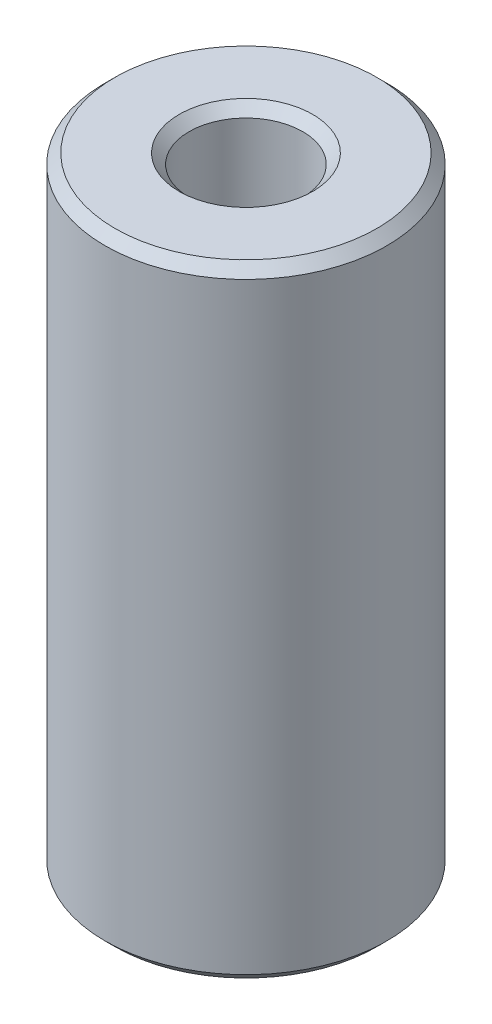
ISO-10303-21;
HEADER;
FILE_DESCRIPTION(('STEP AP214'),'2;1');
FILE_NAME('part.step','',(''),(''),'','','');
FILE_SCHEMA(('AUTOMOTIVE_DESIGN { 1 0 10303 214 1 1 1 1 }'));
ENDSEC;
DATA;
#1=APPLICATION_CONTEXT('core data for automotive mechanical design processes');
#2=APPLICATION_PROTOCOL_DEFINITION('international standard','automotive_design',2000,#1);
#3=PRODUCT_CONTEXT('',#1,'mechanical');
#4=PRODUCT('Part','Part','',(#3));
#5=PRODUCT_RELATED_PRODUCT_CATEGORY('part','',(#4));
#6=PRODUCT_DEFINITION_FORMATION('','',#4);
#7=PRODUCT_DEFINITION_CONTEXT('part definition',#1,'design');
#8=PRODUCT_DEFINITION('design','',#6,#7);
#9=PRODUCT_DEFINITION_SHAPE('','',#8);
#10=(LENGTH_UNIT() NAMED_UNIT(*) SI_UNIT(.MILLI.,.METRE.));
#11=(NAMED_UNIT(*) PLANE_ANGLE_UNIT() SI_UNIT($,.RADIAN.));
#12=(NAMED_UNIT(*) SI_UNIT($,.STERADIAN.) SOLID_ANGLE_UNIT());
#13=UNCERTAINTY_MEASURE_WITH_UNIT(LENGTH_MEASURE(1.E-05),#10,'distance_accuracy_value','');
#14=(GEOMETRIC_REPRESENTATION_CONTEXT(3) GLOBAL_UNCERTAINTY_ASSIGNED_CONTEXT((#13)) GLOBAL_UNIT_ASSIGNED_CONTEXT((#10,
#11,#12)) REPRESENTATION_CONTEXT('',''));
#15=CARTESIAN_POINT('',(0.,0.,0.));
#16=DIRECTION('',(0.,0.,1.));
#17=DIRECTION('',(1.,0.,0.));
#18=AXIS2_PLACEMENT_3D('',#15,#16,#17);
#19=CARTESIAN_POINT('',(0.,99.3283086038093,0.));
#20=DIRECTION('',(0.,-1.,0.));
#21=DIRECTION('',(0.,0.,-1.));
#22=AXIS2_PLACEMENT_3D('',#19,#20,#21);
#23=CYLINDRICAL_SURFACE('',#22,22.5);
#24=CARTESIAN_POINT('',(0.,1.59020851272115,0.));
#25=DIRECTION('',(0.,1.,0.));
#26=DIRECTION('',(0.,0.,1.));
#27=AXIS2_PLACEMENT_3D('',#24,#25,#26);
#28=CIRCLE('',#27,22.5);
#29=CARTESIAN_POINT('',(0.,1.59020851272115,22.5));
#30=VERTEX_POINT('',#29);
#31=EDGE_CURVE('E10',#30,#30,#28,.T.);
#32=ORIENTED_EDGE('',*,*,#31,.T.);
#33=EDGE_LOOP('',(#32));
#34=FACE_BOUND('',#33,.T.);
#35=CARTESIAN_POINT('',(0.,97.7381000910882,0.));
#36=DIRECTION('',(0.,1.,0.));
#37=DIRECTION('',(0.,0.,1.));
#38=AXIS2_PLACEMENT_3D('',#35,#36,#37);
#39=CIRCLE('',#38,22.5);
#40=CARTESIAN_POINT('',(0.,97.7381000910882,22.5));
#41=VERTEX_POINT('',#40);
#42=EDGE_CURVE('E50',#41,#41,#39,.F.);
#43=ORIENTED_EDGE('',*,*,#42,.T.);
#44=EDGE_LOOP('',(#43));
#45=FACE_BOUND('',#44,.T.);
#46=ADVANCED_FACE('F39',(#34,#45),#23,.T.);
#47=CARTESIAN_POINT('',(0.,99.3283086038093,0.));
#48=DIRECTION('',(0.,1.,0.));
#49=DIRECTION('',(0.,0.,1.));
#50=AXIS2_PLACEMENT_3D('',#47,#48,#49);
#51=PLANE('',#50);
#52=CARTESIAN_POINT('',(0.,99.3283086038093,0.));
#53=DIRECTION('',(0.,1.,0.));
#54=DIRECTION('',(0.,0.,1.));
#55=AXIS2_PLACEMENT_3D('',#52,#53,#54);
#56=CIRCLE('',#55,10.6645658844029);
#57=CARTESIAN_POINT('',(0.,99.3283086038093,10.6645658844029));
#58=VERTEX_POINT('',#57);
#59=EDGE_CURVE('E58',#58,#58,#56,.F.);
#60=ORIENTED_EDGE('',*,*,#59,.T.);
#61=EDGE_LOOP('',(#60));
#62=FACE_BOUND('',#61,.T.);
#63=CARTESIAN_POINT('',(0.,99.3283086038093,0.));
#64=DIRECTION('',(0.,1.,0.));
#65=DIRECTION('',(0.,0.,1.));
#66=AXIS2_PLACEMENT_3D('',#63,#64,#65);
#67=CIRCLE('',#66,20.9097914872789);
#68=CARTESIAN_POINT('',(0.,99.3283086038093,20.9097914872789));
#69=VERTEX_POINT('',#68);
#70=EDGE_CURVE('E61',#69,#69,#67,.T.);
#71=ORIENTED_EDGE('',*,*,#70,.T.);
#72=EDGE_LOOP('',(#71));
#73=FACE_BOUND('',#72,.T.);
#74=ADVANCED_FACE('F88',(#62,#73),#51,.T.);
#75=CARTESIAN_POINT('',(0.,0.,0.));
#76=DIRECTION('',(0.,1.,0.));
#77=DIRECTION('',(0.,0.,1.));
#78=AXIS2_PLACEMENT_3D('',#75,#76,#77);
#79=PLANE('',#78);
#80=CARTESIAN_POINT('',(0.,0.,0.));
#81=DIRECTION('',(0.,1.,0.));
#82=DIRECTION('',(0.,0.,1.));
#83=AXIS2_PLACEMENT_3D('',#80,#81,#82);
#84=CIRCLE('',#83,10.6645658844029);
#85=CARTESIAN_POINT('',(0.,0.,-10.6645658844029));
#86=VERTEX_POINT('',#85);
#87=EDGE_CURVE('E51',#86,#86,#84,.T.);
#88=ORIENTED_EDGE('',*,*,#87,.T.);
#89=EDGE_LOOP('',(#88));
#90=FACE_BOUND('',#89,.T.);
#91=CARTESIAN_POINT('',(0.,0.,0.));
#92=DIRECTION('',(0.,1.,0.));
#93=DIRECTION('',(0.,0.,1.));
#94=AXIS2_PLACEMENT_3D('',#91,#92,#93);
#95=CIRCLE('',#94,20.9097914872788);
#96=CARTESIAN_POINT('',(0.,0.,20.9097914872788));
#97=VERTEX_POINT('',#96);
#98=EDGE_CURVE('E54',#97,#97,#95,.F.);
#99=ORIENTED_EDGE('',*,*,#98,.T.);
#100=EDGE_LOOP('',(#99));
#101=FACE_BOUND('',#100,.T.);
#102=ADVANCED_FACE('F83',(#90,#101),#79,.F.);
#103=CARTESIAN_POINT('',(0.,99.3283086038093,0.));
#104=DIRECTION('',(0.,-1.,0.));
#105=DIRECTION('',(0.,0.,-1.));
#106=AXIS2_PLACEMENT_3D('',#103,#104,#105);
#107=CYLINDRICAL_SURFACE('',#106,9.07435737168178);
#108=CARTESIAN_POINT('',(0.,97.7381000910882,0.));
#109=DIRECTION('',(0.,1.,0.));
#110=DIRECTION('',(0.,0.,1.));
#111=AXIS2_PLACEMENT_3D('',#108,#109,#110);
#112=CIRCLE('',#111,9.07435737168178);
#113=CARTESIAN_POINT('',(0.,97.7381000910882,9.07435737168178));
#114=VERTEX_POINT('',#113);
#115=EDGE_CURVE('E67',#114,#114,#112,.T.);
#116=ORIENTED_EDGE('',*,*,#115,.T.);
#117=EDGE_LOOP('',(#116));
#118=FACE_BOUND('',#117,.T.);
#119=CARTESIAN_POINT('',(0.,1.59020851272115,0.));
#120=DIRECTION('',(0.,1.,0.));
#121=DIRECTION('',(0.,0.,1.));
#122=AXIS2_PLACEMENT_3D('',#119,#120,#121);
#123=CIRCLE('',#122,9.07435737168178);
#124=CARTESIAN_POINT('',(0.,1.59020851272115,-9.07435737168178));
#125=VERTEX_POINT('',#124);
#126=EDGE_CURVE('E69',#125,#125,#123,.F.);
#127=ORIENTED_EDGE('',*,*,#126,.T.);
#128=EDGE_LOOP('',(#127));
#129=FACE_BOUND('',#128,.T.);
#130=ADVANCED_FACE('F71',(#118,#129),#107,.F.);
#131=CARTESIAN_POINT('',(0.,97.7381000910882,0.));
#132=DIRECTION('',(0.,1.,0.));
#133=DIRECTION('',(0.,0.,1.));
#134=AXIS2_PLACEMENT_3D('',#131,#132,#133);
#135=CONICAL_SURFACE('',#134,9.07435737168178,0.785398163397447);
#136=ORIENTED_EDGE('',*,*,#59,.F.);
#137=EDGE_LOOP('',(#136));
#138=FACE_BOUND('',#137,.T.);
#139=ORIENTED_EDGE('',*,*,#115,.F.);
#140=EDGE_LOOP('',(#139));
#141=FACE_BOUND('',#140,.T.);
#142=ADVANCED_FACE('F77',(#138,#141),#135,.F.);
#143=CARTESIAN_POINT('',(0.,0.,0.));
#144=DIRECTION('',(0.,-1.,0.));
#145=DIRECTION('',(0.,0.,-1.));
#146=AXIS2_PLACEMENT_3D('',#143,#144,#145);
#147=CONICAL_SURFACE('',#146,10.6645658844029,0.785398163397447);
#148=CARTESIAN_POINT('',(0.,1.59020851272115,-9.07435737168178));
#149=CARTESIAN_POINT('',(0.,1.57364384071364,-9.09092204368929));
#150=CARTESIAN_POINT('',(0.,1.55707916870613,-9.1074867156968));
#151=CARTESIAN_POINT('',(0.,1.5239498246911,-9.14061605971183));
#152=CARTESIAN_POINT('',(0.,1.50738515268359,-9.15718073171934));
#153=CARTESIAN_POINT('',(0.,1.47425580866857,-9.19031007573436));
#154=CARTESIAN_POINT('',(0.,1.45769113666106,-9.20687474774187));
#155=CARTESIAN_POINT('',(0.,1.42456179264603,-9.2400040917569));
#156=CARTESIAN_POINT('',(0.,1.40799712063852,-9.25656876376441));
#157=CARTESIAN_POINT('',(0.,1.3748677766235,-9.28969810777943));
#158=CARTESIAN_POINT('',(0.,1.35830310461598,-9.30626277978694));
#159=CARTESIAN_POINT('',(0.,1.32517376060096,-9.33939212380197));
#160=CARTESIAN_POINT('',(0.,1.30860908859345,-9.35595679580948));
#161=CARTESIAN_POINT('',(0.,1.27547974457842,-9.38908613982451));
#162=CARTESIAN_POINT('',(0.,1.25891507257091,-9.40565081183202));
#163=CARTESIAN_POINT('',(0.,1.22578572855589,-9.43878015584704));
#164=CARTESIAN_POINT('',(0.,1.20922105654838,-9.45534482785455));
#165=CARTESIAN_POINT('',(0.,1.17609171253335,-9.48847417186958));
#166=CARTESIAN_POINT('',(0.,1.15952704052584,-9.50503884387709));
#167=CARTESIAN_POINT('',(0.,1.12639769651082,-9.53816818789211));
#168=CARTESIAN_POINT('',(0.,1.1098330245033,-9.55473285989962));
#169=CARTESIAN_POINT('',(0.,1.07670368048828,-9.58786220391465));
#170=CARTESIAN_POINT('',(0.,1.06013900848077,-9.60442687592216));
#171=CARTESIAN_POINT('',(0.,1.02700966446574,-9.63755621993718));
#172=CARTESIAN_POINT('',(0.,1.01044499245823,-9.65412089194469));
#173=CARTESIAN_POINT('',(0.,0.977315648443208,-9.68725023595972));
#174=CARTESIAN_POINT('',(0.,0.960750976435697,-9.70381490796723));
#175=CARTESIAN_POINT('',(0.,0.927621632420673,-9.73694425198226));
#176=CARTESIAN_POINT('',(0.,0.91105696041316,-9.75350892398977));
#177=CARTESIAN_POINT('',(0.,0.877927616398136,-9.78663826800479));
#178=CARTESIAN_POINT('',(0.,0.861362944390624,-9.80320294001231));
#179=CARTESIAN_POINT('',(0.,0.828233600375601,-9.83633228402733));
#180=CARTESIAN_POINT('',(0.,0.811668928368088,-9.85289695603484));
#181=CARTESIAN_POINT('',(0.,0.778539584353064,-9.88602630004987));
#182=CARTESIAN_POINT('',(0.,0.761974912345552,-9.90259097205738));
#183=CARTESIAN_POINT('',(0.,0.728845568330528,-9.9357203160724));
#184=CARTESIAN_POINT('',(0.,0.712280896323016,-9.95228498807991));
#185=CARTESIAN_POINT('',(0.,0.679151552307992,-9.98541433209494));
#186=CARTESIAN_POINT('',(0.,0.66258688030048,-10.0019790041024));
#187=CARTESIAN_POINT('',(0.,0.629457536285456,-10.0351083481175));
#188=CARTESIAN_POINT('',(0.,0.612892864277944,-10.051673020125));
#189=CARTESIAN_POINT('',(0.,0.57976352026292,-10.08480236414));
#190=CARTESIAN_POINT('',(0.,0.563198848255408,-10.1013670361475));
#191=CARTESIAN_POINT('',(0.,0.530069504240384,-10.1344963801625));
#192=CARTESIAN_POINT('',(0.,0.513504832232872,-10.1510610521701));
#193=CARTESIAN_POINT('',(0.,0.480375488217848,-10.1841903961851));
#194=CARTESIAN_POINT('',(0.,0.463810816210336,-10.2007550681926));
#195=CARTESIAN_POINT('',(0.,0.430681472195312,-10.2338844122076));
#196=CARTESIAN_POINT('',(0.,0.4141168001878,-10.2504490842151));
#197=CARTESIAN_POINT('',(0.,0.380987456172776,-10.2835784282302));
#198=CARTESIAN_POINT('',(0.,0.364422784165264,-10.3001431002377));
#199=CARTESIAN_POINT('',(0.,0.33129344015024,-10.3332724442527));
#200=CARTESIAN_POINT('',(0.,0.314728768142728,-10.3498371162602));
#201=CARTESIAN_POINT('',(0.,0.281599424127704,-10.3829664602752));
#202=CARTESIAN_POINT('',(0.,0.265034752120192,-10.3995311322827));
#203=CARTESIAN_POINT('',(0.,0.231905408105168,-10.4326604762978));
#204=CARTESIAN_POINT('',(0.,0.215340736097656,-10.4492251483053));
#205=CARTESIAN_POINT('',(0.,0.182211392082632,-10.4823544923203));
#206=CARTESIAN_POINT('',(0.,0.16564672007512,-10.4989191643278));
#207=CARTESIAN_POINT('',(0.,0.132517376060096,-10.5320485083428));
#208=CARTESIAN_POINT('',(0.,0.115952704052584,-10.5486131803503));
#209=CARTESIAN_POINT('',(0.,0.0828233600375599,-10.5817425243654));
#210=CARTESIAN_POINT('',(0.,0.066258688030048,-10.5983071963729));
#211=CARTESIAN_POINT('',(0.,0.0331293440150243,-10.6314365403879));
#212=CARTESIAN_POINT('',(0.,0.0165646720075125,-10.6480012123954));
#213=CARTESIAN_POINT('',(0.,0.,-10.6645658844029));
#214=B_SPLINE_CURVE_WITH_KNOTS('',3,(#148,#149,#150,#151,#152,#153,#154,#155,#156,#157,#158,
#159,#160,#161,#162,#163,#164,#165,#166,#167,#168,#169,#170,#171,#172,#173,#174,#175,#176,#177,
#178,#179,#180,#181,#182,#183,#184,#185,#186,#187,#188,#189,#190,#191,#192,#193,#194,#195,#196,
#197,#198,#199,#200,#201,#202,#203,#204,#205,#206,#207,#208,#209,#210,#211,#212,#213),
.UNSPECIFIED.,.F.,.F.,(4,2,2,2,2,2,2,2,2,2,2,2,2,2,2,2,2,2,2,2,2,2,2,2,2,2,2,2,2,2,2,2,4),(0.,
0.0702779514278569,0.140555902855713,0.210833854283568,0.281111805711425,0.351389757139281,
0.421667708567138,0.491945659994994,0.562223611422851,0.632501562850706,0.702779514278562,
0.773057465706419,0.843335417134275,0.913613368562132,0.983891319989988,1.05416927141784,
1.1244472228457,1.19472517427356,1.26500312570141,1.33528107712927,1.40555902855713,
1.47583697998498,1.54611493141284,1.61639288284069,1.68667083426855,1.75694878569641,
1.82722673712426,1.89750468855212,1.96778263997997,2.03806059140783,2.10833854283569,
2.17861649426354,2.2488944456914),.UNSPECIFIED.);
#215=EDGE_CURVE('BSEAM73',#125,#86,#214,.T.);
#216=ORIENTED_EDGE('',*,*,#126,.F.);
#217=ORIENTED_EDGE('',*,*,#87,.F.);
#218=ORIENTED_EDGE('',*,*,#215,.T.);
#219=ORIENTED_EDGE('',*,*,#215,.F.);
#220=EDGE_LOOP('',(#216,#218,#217,#219));
#221=FACE_BOUND('',#220,.T.);
#222=ADVANCED_FACE('F73',(#221),#147,.F.);
#223=CARTESIAN_POINT('',(0.,1.59020851272115,0.));
#224=DIRECTION('',(0.,1.,0.));
#225=DIRECTION('',(0.,0.,1.));
#226=AXIS2_PLACEMENT_3D('',#223,#224,#225);
#227=CONICAL_SURFACE('',#226,22.5,0.785398163397453);
#228=CARTESIAN_POINT('',(0.,0.,20.9097914872788));
#229=CARTESIAN_POINT('',(0.,0.0165646720075122,20.9263561592863));
#230=CARTESIAN_POINT('',(0.,0.033129344015024,20.9429208312939));
#231=CARTESIAN_POINT('',(0.,0.0662586880300476,20.9760501753089));
#232=CARTESIAN_POINT('',(0.,0.0828233600375594,20.9926148473164));
#233=CARTESIAN_POINT('',(0.,0.115952704052584,21.0257441913314));
#234=CARTESIAN_POINT('',(0.,0.132517376060096,21.0423088633389));
#235=CARTESIAN_POINT('',(0.,0.16564672007512,21.075438207354));
#236=CARTESIAN_POINT('',(0.,0.182211392082632,21.0920028793615));
#237=CARTESIAN_POINT('',(0.,0.215340736097656,21.1251322233765));
#238=CARTESIAN_POINT('',(0.,0.231905408105168,21.141696895384));
#239=CARTESIAN_POINT('',(0.,0.265034752120192,21.174826239399));
#240=CARTESIAN_POINT('',(0.,0.281599424127704,21.1913909114065));
#241=CARTESIAN_POINT('',(0.,0.314728768142728,21.2245202554216));
#242=CARTESIAN_POINT('',(0.,0.33129344015024,21.2410849274291));
#243=CARTESIAN_POINT('',(0.,0.364422784165264,21.2742142714441));
#244=CARTESIAN_POINT('',(0.,0.380987456172776,21.2907789434516));
#245=CARTESIAN_POINT('',(0.,0.4141168001878,21.3239082874666));
#246=CARTESIAN_POINT('',(0.,0.430681472195312,21.3404729594742));
#247=CARTESIAN_POINT('',(0.,0.463810816210336,21.3736023034892));
#248=CARTESIAN_POINT('',(0.,0.480375488217848,21.3901669754967));
#249=CARTESIAN_POINT('',(0.,0.513504832232872,21.4232963195117));
#250=CARTESIAN_POINT('',(0.,0.530069504240384,21.4398609915192));
#251=CARTESIAN_POINT('',(0.,0.563198848255409,21.4729903355342));
#252=CARTESIAN_POINT('',(0.,0.57976352026292,21.4895550075418));
#253=CARTESIAN_POINT('',(0.,0.612892864277944,21.5226843515568));
#254=CARTESIAN_POINT('',(0.,0.629457536285456,21.5392490235643));
#255=CARTESIAN_POINT('',(0.,0.66258688030048,21.5723783675793));
#256=CARTESIAN_POINT('',(0.,0.679151552307992,21.5889430395868));
#257=CARTESIAN_POINT('',(0.,0.712280896323016,21.6220723836019));
#258=CARTESIAN_POINT('',(0.,0.728845568330528,21.6386370556094));
#259=CARTESIAN_POINT('',(0.,0.761974912345552,21.6717663996244));
#260=CARTESIAN_POINT('',(0.,0.778539584353064,21.6883310716319));
#261=CARTESIAN_POINT('',(0.,0.811668928368088,21.7214604156469));
#262=CARTESIAN_POINT('',(0.,0.8282336003756,21.7380250876544));
#263=CARTESIAN_POINT('',(0.,0.861362944390624,21.7711544316695));
#264=CARTESIAN_POINT('',(0.,0.877927616398136,21.787719103677));
#265=CARTESIAN_POINT('',(0.,0.91105696041316,21.820848447692));
#266=CARTESIAN_POINT('',(0.,0.927621632420672,21.8374131196995));
#267=CARTESIAN_POINT('',(0.,0.960750976435696,21.8705424637145));
#268=CARTESIAN_POINT('',(0.,0.977315648443209,21.8871071357221));
#269=CARTESIAN_POINT('',(0.,1.01044499245823,21.9202364797371));
#270=CARTESIAN_POINT('',(0.,1.02700966446574,21.9368011517446));
#271=CARTESIAN_POINT('',(0.,1.06013900848077,21.9699304957596));
#272=CARTESIAN_POINT('',(0.,1.07670368048828,21.9864951677671));
#273=CARTESIAN_POINT('',(0.,1.1098330245033,22.0196245117822));
#274=CARTESIAN_POINT('',(0.,1.12639769651082,22.0361891837897));
#275=CARTESIAN_POINT('',(0.,1.15952704052584,22.0693185278047));
#276=CARTESIAN_POINT('',(0.,1.17609171253335,22.0858831998122));
#277=CARTESIAN_POINT('',(0.,1.20922105654838,22.1190125438272));
#278=CARTESIAN_POINT('',(0.,1.22578572855589,22.1355772158347));
#279=CARTESIAN_POINT('',(0.,1.25891507257091,22.1687065598498));
#280=CARTESIAN_POINT('',(0.,1.27547974457842,22.1852712318573));
#281=CARTESIAN_POINT('',(0.,1.30860908859345,22.2184005758723));
#282=CARTESIAN_POINT('',(0.,1.32517376060096,22.2349652478798));
#283=CARTESIAN_POINT('',(0.,1.35830310461598,22.2680945918948));
#284=CARTESIAN_POINT('',(0.,1.3748677766235,22.2846592639023));
#285=CARTESIAN_POINT('',(0.,1.40799712063852,22.3177886079174));
#286=CARTESIAN_POINT('',(0.,1.42456179264603,22.3343532799249));
#287=CARTESIAN_POINT('',(0.,1.45769113666106,22.3674826239399));
#288=CARTESIAN_POINT('',(0.,1.47425580866857,22.3840472959474));
#289=CARTESIAN_POINT('',(0.,1.50738515268359,22.4171766399624));
#290=CARTESIAN_POINT('',(0.,1.5239498246911,22.43374131197));
#291=CARTESIAN_POINT('',(0.,1.55707916870613,22.466870655985));
#292=CARTESIAN_POINT('',(0.,1.57364384071364,22.4834353279925));
#293=CARTESIAN_POINT('',(0.,1.59020851272115,22.5));
#294=B_SPLINE_CURVE_WITH_KNOTS('',3,(#228,#229,#230,#231,#232,#233,#234,#235,#236,#237,#238,
#239,#240,#241,#242,#243,#244,#245,#246,#247,#248,#249,#250,#251,#252,#253,#254,#255,#256,#257,
#258,#259,#260,#261,#262,#263,#264,#265,#266,#267,#268,#269,#270,#271,#272,#273,#274,#275,#276,
#277,#278,#279,#280,#281,#282,#283,#284,#285,#286,#287,#288,#289,#290,#291,#292,#293),
.UNSPECIFIED.,.F.,.F.,(4,2,2,2,2,2,2,2,2,2,2,2,2,2,2,2,2,2,2,2,2,2,2,2,2,2,2,2,2,2,2,2,4),(0.,
0.0702779514278569,0.140555902855714,0.210833854283568,0.281111805711425,0.351389757139282,
0.421667708567139,0.491945659994996,0.562223611422853,0.63250156285071,0.702779514278567,
0.773057465706422,0.843335417134279,0.913613368562135,0.983891319989993,1.05416927141785,
1.12444722284571,1.19472517427356,1.26500312570142,1.33528107712928,1.40555902855713,
1.47583697998499,1.54611493141285,1.6163928828407,1.68667083426856,1.75694878569642,
1.82722673712427,1.89750468855213,1.96778263997998,2.03806059140784,2.1083385428357,
2.17861649426356,2.24889444569141),.UNSPECIFIED.);
#295=EDGE_CURVE('BSEAM76',#97,#30,#294,.T.);
#296=ORIENTED_EDGE('',*,*,#98,.F.);
#297=ORIENTED_EDGE('',*,*,#31,.F.);
#298=ORIENTED_EDGE('',*,*,#295,.T.);
#299=ORIENTED_EDGE('',*,*,#295,.F.);
#300=EDGE_LOOP('',(#296,#298,#297,#299));
#301=FACE_BOUND('',#300,.T.);
#302=ADVANCED_FACE('F76',(#301),#227,.T.);
#303=CARTESIAN_POINT('',(0.,99.3283086038093,0.));
#304=DIRECTION('',(0.,-1.,0.));
#305=DIRECTION('',(0.,0.,-1.));
#306=AXIS2_PLACEMENT_3D('',#303,#304,#305);
#307=CONICAL_SURFACE('',#306,20.9097914872789,0.785398163397443);
#308=ORIENTED_EDGE('',*,*,#42,.F.);
#309=EDGE_LOOP('',(#308));
#310=FACE_BOUND('',#309,.T.);
#311=ORIENTED_EDGE('',*,*,#70,.F.);
#312=EDGE_LOOP('',(#311));
#313=FACE_BOUND('',#312,.T.);
#314=ADVANCED_FACE('F45',(#310,#313),#307,.T.);
#315=CLOSED_SHELL('',(#46,#74,#102,#130,#142,#222,#302,#314));
#316=MANIFOLD_SOLID_BREP('B2',#315);
#317=ADVANCED_BREP_SHAPE_REPRESENTATION('',(#18,#316),#14);
#318=SHAPE_DEFINITION_REPRESENTATION(#9,#317);
ENDSEC;
END-ISO-10303-21;
